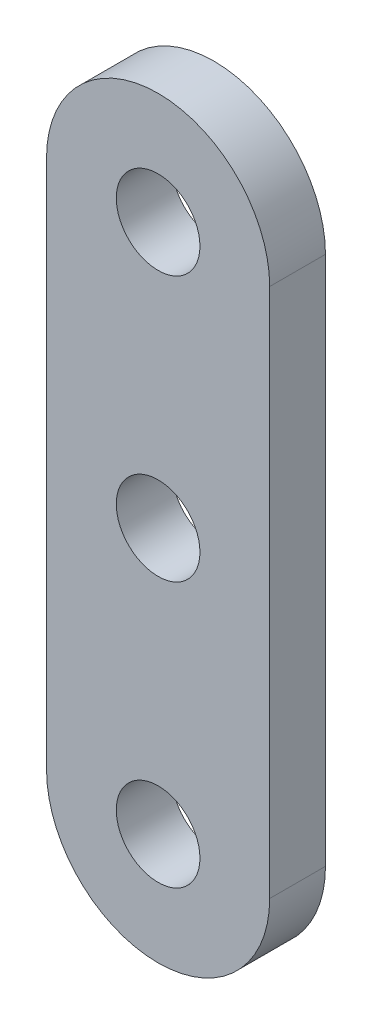
ISO-10303-21;
HEADER;
FILE_DESCRIPTION(('STEP AP214'),'2;1');
FILE_NAME('part.step','',(''),(''),'','','');
FILE_SCHEMA(('AUTOMOTIVE_DESIGN { 1 0 10303 214 1 1 1 1 }'));
ENDSEC;
DATA;
#1=APPLICATION_CONTEXT('core data for automotive mechanical design processes');
#2=APPLICATION_PROTOCOL_DEFINITION('international standard','automotive_design',2000,#1);
#3=PRODUCT_CONTEXT('',#1,'mechanical');
#4=PRODUCT('Part','Part','',(#3));
#5=PRODUCT_RELATED_PRODUCT_CATEGORY('part','',(#4));
#6=PRODUCT_DEFINITION_FORMATION('','',#4);
#7=PRODUCT_DEFINITION_CONTEXT('part definition',#1,'design');
#8=PRODUCT_DEFINITION('design','',#6,#7);
#9=PRODUCT_DEFINITION_SHAPE('','',#8);
#10=(LENGTH_UNIT() NAMED_UNIT(*) SI_UNIT(.MILLI.,.METRE.));
#11=(NAMED_UNIT(*) PLANE_ANGLE_UNIT() SI_UNIT($,.RADIAN.));
#12=(NAMED_UNIT(*) SI_UNIT($,.STERADIAN.) SOLID_ANGLE_UNIT());
#13=UNCERTAINTY_MEASURE_WITH_UNIT(LENGTH_MEASURE(1.E-05),#10,'distance_accuracy_value','');
#14=(GEOMETRIC_REPRESENTATION_CONTEXT(3) GLOBAL_UNCERTAINTY_ASSIGNED_CONTEXT((#13)) GLOBAL_UNIT_ASSIGNED_CONTEXT((#10,
#11,#12)) REPRESENTATION_CONTEXT('',''));
#15=CARTESIAN_POINT('',(0.,0.,0.));
#16=DIRECTION('',(0.,0.,1.));
#17=DIRECTION('',(1.,0.,0.));
#18=AXIS2_PLACEMENT_3D('',#15,#16,#17);
#19=CARTESIAN_POINT('',(6.35,0.,3.175));
#20=DIRECTION('',(-1.,0.,0.));
#21=DIRECTION('',(0.,0.,1.));
#22=AXIS2_PLACEMENT_3D('',#19,#20,#21);
#23=PLANE('',#22);
#24=DIRECTION('',(0.,1.,0.));
#25=VECTOR('',#24,1.);
#26=CARTESIAN_POINT('',(6.35,0.,0.));
#27=LINE('',#26,#25);
#28=CARTESIAN_POINT('',(6.35,0.,0.));
#29=VERTEX_POINT('',#28);
#30=CARTESIAN_POINT('',(6.35,30.1625,0.));
#31=VERTEX_POINT('',#30);
#32=EDGE_CURVE('E105',#29,#31,#27,.T.);
#33=ORIENTED_EDGE('',*,*,#32,.T.);
#34=DIRECTION('',(0.,0.,-1.));
#35=VECTOR('',#34,1.);
#36=CARTESIAN_POINT('',(6.35,30.1625,3.175));
#37=LINE('',#36,#35);
#38=CARTESIAN_POINT('',(6.35,30.1625,3.175));
#39=VERTEX_POINT('',#38);
#40=EDGE_CURVE('E11',#39,#31,#37,.T.);
#41=ORIENTED_EDGE('',*,*,#40,.F.);
#42=DIRECTION('',(0.,1.,0.));
#43=VECTOR('',#42,1.);
#44=CARTESIAN_POINT('',(6.35,0.,3.175));
#45=LINE('',#44,#43);
#46=CARTESIAN_POINT('',(6.35,0.,3.175));
#47=VERTEX_POINT('',#46);
#48=EDGE_CURVE('E83',#47,#39,#45,.T.);
#49=ORIENTED_EDGE('',*,*,#48,.F.);
#50=DIRECTION('',(0.,0.,-1.));
#51=VECTOR('',#50,1.);
#52=CARTESIAN_POINT('',(6.35,0.,3.175));
#53=LINE('',#52,#51);
#54=EDGE_CURVE('E94',#47,#29,#53,.T.);
#55=ORIENTED_EDGE('',*,*,#54,.T.);
#56=EDGE_LOOP('',(#33,#41,#49,#55));
#57=FACE_BOUND('',#56,.T.);
#58=ADVANCED_FACE('F35',(#57),#23,.F.);
#59=CARTESIAN_POINT('',(0.,30.1625,3.175));
#60=DIRECTION('',(0.,0.,-1.));
#61=DIRECTION('',(-1.,0.,0.));
#62=AXIS2_PLACEMENT_3D('',#59,#60,#61);
#63=CYLINDRICAL_SURFACE('',#62,6.35);
#64=CARTESIAN_POINT('',(0.,30.1625,0.));
#65=DIRECTION('',(0.,0.,1.));
#66=DIRECTION('',(1.,0.,0.));
#67=AXIS2_PLACEMENT_3D('',#64,#65,#66);
#68=CIRCLE('',#67,6.35);
#69=CARTESIAN_POINT('',(-6.35,30.1625,0.));
#70=VERTEX_POINT('',#69);
#71=EDGE_CURVE('E88',#31,#70,#68,.T.);
#72=ORIENTED_EDGE('',*,*,#71,.T.);
#73=DIRECTION('',(0.,0.,-1.));
#74=VECTOR('',#73,1.);
#75=CARTESIAN_POINT('',(-6.35,30.1625,3.175));
#76=LINE('',#75,#74);
#77=CARTESIAN_POINT('',(-6.35,30.1625,3.175));
#78=VERTEX_POINT('',#77);
#79=EDGE_CURVE('E44',#78,#70,#76,.T.);
#80=ORIENTED_EDGE('',*,*,#79,.F.);
#81=CARTESIAN_POINT('',(0.,30.1625,3.175));
#82=DIRECTION('',(0.,0.,1.));
#83=DIRECTION('',(1.,0.,0.));
#84=AXIS2_PLACEMENT_3D('',#81,#82,#83);
#85=CIRCLE('',#84,6.35);
#86=EDGE_CURVE('E78',#39,#78,#85,.T.);
#87=ORIENTED_EDGE('',*,*,#86,.F.);
#88=ORIENTED_EDGE('',*,*,#40,.T.);
#89=EDGE_LOOP('',(#72,#80,#87,#88));
#90=FACE_BOUND('',#89,.T.);
#91=ADVANCED_FACE('F87',(#90),#63,.T.);
#92=CARTESIAN_POINT('',(-6.35,0.,3.175));
#93=DIRECTION('',(-1.,0.,0.));
#94=DIRECTION('',(0.,0.,1.));
#95=AXIS2_PLACEMENT_3D('',#92,#93,#94);
#96=PLANE('',#95);
#97=DIRECTION('',(0.,1.,0.));
#98=VECTOR('',#97,1.);
#99=CARTESIAN_POINT('',(-6.35,0.,0.));
#100=LINE('',#99,#98);
#101=CARTESIAN_POINT('',(-6.35,0.,0.));
#102=VERTEX_POINT('',#101);
#103=EDGE_CURVE('E109',#102,#70,#100,.T.);
#104=ORIENTED_EDGE('',*,*,#103,.F.);
#105=DIRECTION('',(0.,0.,-1.));
#106=VECTOR('',#105,1.);
#107=CARTESIAN_POINT('',(-6.35,0.,3.175));
#108=LINE('',#107,#106);
#109=CARTESIAN_POINT('',(-6.35,0.,3.175));
#110=VERTEX_POINT('',#109);
#111=EDGE_CURVE('E68',#110,#102,#108,.T.);
#112=ORIENTED_EDGE('',*,*,#111,.F.);
#113=DIRECTION('',(0.,1.,0.));
#114=VECTOR('',#113,1.);
#115=CARTESIAN_POINT('',(-6.35,0.,3.175));
#116=LINE('',#115,#114);
#117=EDGE_CURVE('E81',#110,#78,#116,.T.);
#118=ORIENTED_EDGE('',*,*,#117,.T.);
#119=ORIENTED_EDGE('',*,*,#79,.T.);
#120=EDGE_LOOP('',(#104,#112,#118,#119));
#121=FACE_BOUND('',#120,.T.);
#122=ADVANCED_FACE('F92',(#121),#96,.T.);
#123=CARTESIAN_POINT('',(0.,30.1625,3.175));
#124=DIRECTION('',(0.,0.,-1.));
#125=DIRECTION('',(-1.,0.,0.));
#126=AXIS2_PLACEMENT_3D('',#123,#124,#125);
#127=CYLINDRICAL_SURFACE('',#126,2.38125);
#128=CARTESIAN_POINT('',(0.,30.1625,3.175));
#129=DIRECTION('',(0.,0.,1.));
#130=DIRECTION('',(1.,0.,0.));
#131=AXIS2_PLACEMENT_3D('',#128,#129,#130);
#132=CIRCLE('',#131,2.38125);
#133=CARTESIAN_POINT('',(2.38125,30.1625,3.175));
#134=VERTEX_POINT('',#133);
#135=EDGE_CURVE('E152',#134,#134,#132,.T.);
#136=ORIENTED_EDGE('',*,*,#135,.T.);
#137=EDGE_LOOP('',(#136));
#138=FACE_BOUND('',#137,.T.);
#139=CARTESIAN_POINT('',(0.,30.1625,0.));
#140=DIRECTION('',(0.,0.,1.));
#141=DIRECTION('',(1.,0.,0.));
#142=AXIS2_PLACEMENT_3D('',#139,#140,#141);
#143=CIRCLE('',#142,2.38125);
#144=CARTESIAN_POINT('',(2.38125,30.1625,0.));
#145=VERTEX_POINT('',#144);
#146=EDGE_CURVE('E101',#145,#145,#143,.T.);
#147=ORIENTED_EDGE('',*,*,#146,.F.);
#148=EDGE_LOOP('',(#147));
#149=FACE_BOUND('',#148,.T.);
#150=ADVANCED_FACE('F141',(#138,#149),#127,.F.);
#151=CARTESIAN_POINT('',(0.,0.,3.175));
#152=DIRECTION('',(0.,0.,-1.));
#153=DIRECTION('',(-1.,0.,0.));
#154=AXIS2_PLACEMENT_3D('',#151,#152,#153);
#155=CYLINDRICAL_SURFACE('',#154,2.38125);
#156=CARTESIAN_POINT('',(0.,0.,3.175));
#157=DIRECTION('',(0.,0.,1.));
#158=DIRECTION('',(1.,0.,0.));
#159=AXIS2_PLACEMENT_3D('',#156,#157,#158);
#160=CIRCLE('',#159,2.38125);
#161=CARTESIAN_POINT('',(2.38125,0.,3.175));
#162=VERTEX_POINT('',#161);
#163=EDGE_CURVE('E112',#162,#162,#160,.T.);
#164=ORIENTED_EDGE('',*,*,#163,.T.);
#165=EDGE_LOOP('',(#164));
#166=FACE_BOUND('',#165,.T.);
#167=CARTESIAN_POINT('',(0.,0.,0.));
#168=DIRECTION('',(0.,0.,1.));
#169=DIRECTION('',(1.,0.,0.));
#170=AXIS2_PLACEMENT_3D('',#167,#168,#169);
#171=CIRCLE('',#170,2.38125);
#172=CARTESIAN_POINT('',(2.38125,0.,0.));
#173=VERTEX_POINT('',#172);
#174=EDGE_CURVE('E98',#173,#173,#171,.T.);
#175=ORIENTED_EDGE('',*,*,#174,.F.);
#176=EDGE_LOOP('',(#175));
#177=FACE_BOUND('',#176,.T.);
#178=ADVANCED_FACE('F37',(#166,#177),#155,.F.);
#179=CARTESIAN_POINT('',(0.,0.,3.175));
#180=DIRECTION('',(0.,0.,-1.));
#181=DIRECTION('',(-1.,0.,0.));
#182=AXIS2_PLACEMENT_3D('',#179,#180,#181);
#183=CYLINDRICAL_SURFACE('',#182,6.35);
#184=CARTESIAN_POINT('',(0.,0.,0.));
#185=DIRECTION('',(0.,0.,1.));
#186=DIRECTION('',(1.,0.,0.));
#187=AXIS2_PLACEMENT_3D('',#184,#185,#186);
#188=CIRCLE('',#187,6.35);
#189=EDGE_CURVE('E71',#102,#29,#188,.T.);
#190=ORIENTED_EDGE('',*,*,#189,.T.);
#191=ORIENTED_EDGE('',*,*,#54,.F.);
#192=CARTESIAN_POINT('',(0.,0.,3.175));
#193=DIRECTION('',(0.,0.,1.));
#194=DIRECTION('',(1.,0.,0.));
#195=AXIS2_PLACEMENT_3D('',#192,#193,#194);
#196=CIRCLE('',#195,6.35);
#197=EDGE_CURVE('E52',#110,#47,#196,.T.);
#198=ORIENTED_EDGE('',*,*,#197,.F.);
#199=ORIENTED_EDGE('',*,*,#111,.T.);
#200=EDGE_LOOP('',(#190,#191,#198,#199));
#201=FACE_BOUND('',#200,.T.);
#202=ADVANCED_FACE('F128',(#201),#183,.T.);
#203=CARTESIAN_POINT('',(0.,0.,3.175));
#204=DIRECTION('',(0.,0.,1.));
#205=DIRECTION('',(1.,0.,0.));
#206=AXIS2_PLACEMENT_3D('',#203,#204,#205);
#207=PLANE('',#206);
#208=CARTESIAN_POINT('',(0.,15.08125,3.175));
#209=DIRECTION('',(0.,0.,1.));
#210=DIRECTION('',(1.,0.,0.));
#211=AXIS2_PLACEMENT_3D('',#208,#209,#210);
#212=CIRCLE('',#211,2.38125);
#213=CARTESIAN_POINT('',(2.38125,15.08125,3.175));
#214=VERTEX_POINT('',#213);
#215=EDGE_CURVE('E160',#214,#214,#212,.T.);
#216=ORIENTED_EDGE('',*,*,#215,.F.);
#217=EDGE_LOOP('',(#216));
#218=FACE_BOUND('',#217,.T.);
#219=ORIENTED_EDGE('',*,*,#163,.F.);
#220=EDGE_LOOP('',(#219));
#221=FACE_BOUND('',#220,.T.);
#222=ORIENTED_EDGE('',*,*,#135,.F.);
#223=EDGE_LOOP('',(#222));
#224=FACE_BOUND('',#223,.T.);
#225=ORIENTED_EDGE('',*,*,#48,.T.);
#226=ORIENTED_EDGE('',*,*,#86,.T.);
#227=ORIENTED_EDGE('',*,*,#117,.F.);
#228=ORIENTED_EDGE('',*,*,#197,.T.);
#229=EDGE_LOOP('',(#225,#226,#227,#228));
#230=FACE_BOUND('',#229,.T.);
#231=ADVANCED_FACE('F79',(#218,#221,#224,#230),#207,.T.);
#232=CARTESIAN_POINT('',(0.,0.,0.));
#233=DIRECTION('',(0.,0.,1.));
#234=DIRECTION('',(1.,0.,0.));
#235=AXIS2_PLACEMENT_3D('',#232,#233,#234);
#236=PLANE('',#235);
#237=CARTESIAN_POINT('',(0.,15.08125,0.));
#238=DIRECTION('',(0.,0.,1.));
#239=DIRECTION('',(1.,0.,0.));
#240=AXIS2_PLACEMENT_3D('',#237,#238,#239);
#241=CIRCLE('',#240,2.38125);
#242=CARTESIAN_POINT('',(2.38125,15.08125,0.));
#243=VERTEX_POINT('',#242);
#244=EDGE_CURVE('E102',#243,#243,#241,.T.);
#245=ORIENTED_EDGE('',*,*,#244,.T.);
#246=EDGE_LOOP('',(#245));
#247=FACE_BOUND('',#246,.T.);
#248=ORIENTED_EDGE('',*,*,#174,.T.);
#249=EDGE_LOOP('',(#248));
#250=FACE_BOUND('',#249,.T.);
#251=ORIENTED_EDGE('',*,*,#146,.T.);
#252=EDGE_LOOP('',(#251));
#253=FACE_BOUND('',#252,.T.);
#254=ORIENTED_EDGE('',*,*,#32,.F.);
#255=ORIENTED_EDGE('',*,*,#189,.F.);
#256=ORIENTED_EDGE('',*,*,#103,.T.);
#257=ORIENTED_EDGE('',*,*,#71,.F.);
#258=EDGE_LOOP('',(#254,#255,#256,#257));
#259=FACE_BOUND('',#258,.T.);
#260=ADVANCED_FACE('F117',(#247,#250,#253,#259),#236,.F.);
#261=CARTESIAN_POINT('',(0.,15.08125,0.));
#262=DIRECTION('',(0.,0.,1.));
#263=DIRECTION('',(1.,0.,0.));
#264=AXIS2_PLACEMENT_3D('',#261,#262,#263);
#265=CYLINDRICAL_SURFACE('',#264,2.38125);
#266=ORIENTED_EDGE('',*,*,#244,.F.);
#267=EDGE_LOOP('',(#266));
#268=FACE_BOUND('',#267,.T.);
#269=ORIENTED_EDGE('',*,*,#215,.T.);
#270=EDGE_LOOP('',(#269));
#271=FACE_BOUND('',#270,.T.);
#272=ADVANCED_FACE('F119',(#268,#271),#265,.F.);
#273=CLOSED_SHELL('',(#58,#91,#122,#150,#178,#202,#231,#260,#272));
#274=MANIFOLD_SOLID_BREP('B2',#273);
#275=ADVANCED_BREP_SHAPE_REPRESENTATION('',(#18,#274),#14);
#276=SHAPE_DEFINITION_REPRESENTATION(#9,#275);
ENDSEC;
END-ISO-10303-21;
